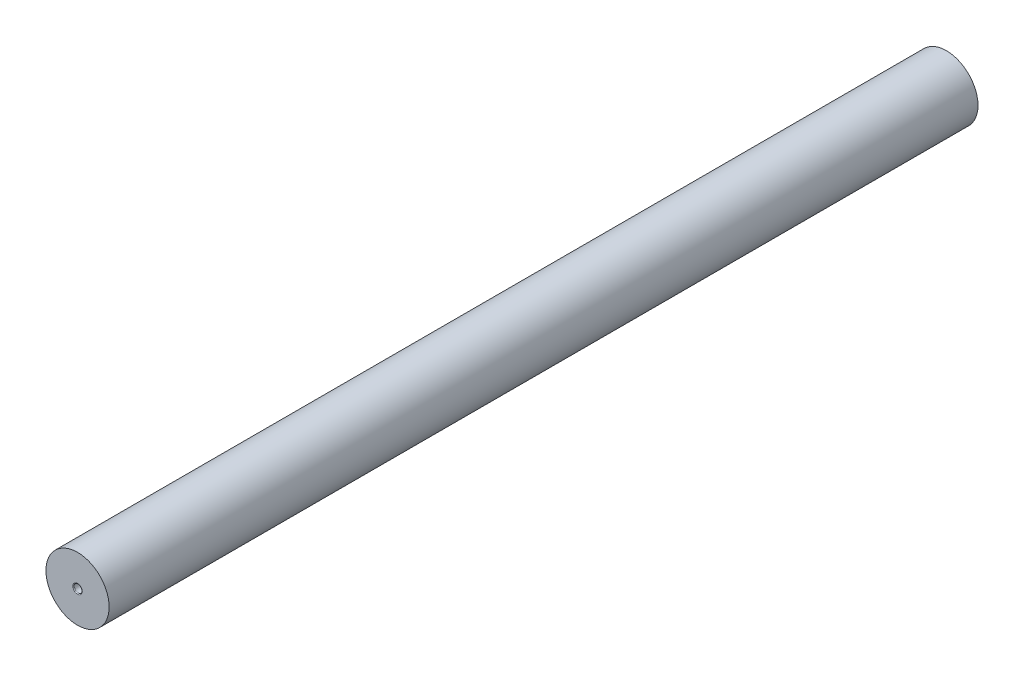
ISO-10303-21;
HEADER;
FILE_DESCRIPTION(('STEP AP214'),'2;1');
FILE_NAME('part.step','',(''),(''),'','','');
FILE_SCHEMA(('AUTOMOTIVE_DESIGN { 1 0 10303 214 1 1 1 1 }'));
ENDSEC;
DATA;
#1=APPLICATION_CONTEXT('core data for automotive mechanical design processes');
#2=APPLICATION_PROTOCOL_DEFINITION('international standard','automotive_design',2000,#1);
#3=PRODUCT_CONTEXT('',#1,'mechanical');
#4=PRODUCT('Part','Part','',(#3));
#5=PRODUCT_RELATED_PRODUCT_CATEGORY('part','',(#4));
#6=PRODUCT_DEFINITION_FORMATION('','',#4);
#7=PRODUCT_DEFINITION_CONTEXT('part definition',#1,'design');
#8=PRODUCT_DEFINITION('design','',#6,#7);
#9=PRODUCT_DEFINITION_SHAPE('','',#8);
#10=(LENGTH_UNIT() NAMED_UNIT(*) SI_UNIT(.MILLI.,.METRE.));
#11=(NAMED_UNIT(*) PLANE_ANGLE_UNIT() SI_UNIT($,.RADIAN.));
#12=(NAMED_UNIT(*) SI_UNIT($,.STERADIAN.) SOLID_ANGLE_UNIT());
#13=UNCERTAINTY_MEASURE_WITH_UNIT(LENGTH_MEASURE(1.E-05),#10,'distance_accuracy_value','');
#14=(GEOMETRIC_REPRESENTATION_CONTEXT(3) GLOBAL_UNCERTAINTY_ASSIGNED_CONTEXT((#13)) GLOBAL_UNIT_ASSIGNED_CONTEXT((#10,
#11,#12)) REPRESENTATION_CONTEXT('',''));
#15=CARTESIAN_POINT('',(0.,0.,0.));
#16=DIRECTION('',(0.,0.,1.));
#17=DIRECTION('',(1.,0.,0.));
#18=AXIS2_PLACEMENT_3D('',#15,#16,#17);
#19=CARTESIAN_POINT('',(0.,0.,110.));
#20=DIRECTION('',(0.,0.,-1.));
#21=DIRECTION('',(-1.,0.,0.));
#22=AXIS2_PLACEMENT_3D('',#19,#20,#21);
#23=CYLINDRICAL_SURFACE('',#22,4.);
#24=CARTESIAN_POINT('',(0.,0.,110.));
#25=DIRECTION('',(0.,0.,1.));
#26=DIRECTION('',(1.,0.,0.));
#27=AXIS2_PLACEMENT_3D('',#24,#25,#26);
#28=CIRCLE('',#27,4.);
#29=CARTESIAN_POINT('',(4.,0.,110.));
#30=VERTEX_POINT('',#29);
#31=EDGE_CURVE('E44',#30,#30,#28,.T.);
#32=ORIENTED_EDGE('',*,*,#31,.F.);
#33=EDGE_LOOP('',(#32));
#34=FACE_BOUND('',#33,.T.);
#35=CARTESIAN_POINT('',(0.,0.,0.));
#36=DIRECTION('',(0.,0.,1.));
#37=DIRECTION('',(1.,0.,0.));
#38=AXIS2_PLACEMENT_3D('',#35,#36,#37);
#39=CIRCLE('',#38,4.);
#40=CARTESIAN_POINT('',(4.,0.,0.));
#41=VERTEX_POINT('',#40);
#42=EDGE_CURVE('E48',#41,#41,#39,.T.);
#43=ORIENTED_EDGE('',*,*,#42,.T.);
#44=EDGE_LOOP('',(#43));
#45=FACE_BOUND('',#44,.T.);
#46=ADVANCED_FACE('F33',(#34,#45),#23,.T.);
#47=CARTESIAN_POINT('',(0.,0.,110.));
#48=DIRECTION('',(0.,0.,1.));
#49=DIRECTION('',(1.,0.,0.));
#50=AXIS2_PLACEMENT_3D('',#47,#48,#49);
#51=PLANE('',#50);
#52=CARTESIAN_POINT('',(0.,0.,110.));
#53=DIRECTION('',(0.,0.,1.));
#54=DIRECTION('',(1.,0.,0.));
#55=AXIS2_PLACEMENT_3D('',#52,#53,#54);
#56=CIRCLE('',#55,0.6);
#57=CARTESIAN_POINT('',(0.6,0.,110.));
#58=VERTEX_POINT('',#57);
#59=EDGE_CURVE('E10',#58,#58,#56,.F.);
#60=ORIENTED_EDGE('',*,*,#59,.T.);
#61=EDGE_LOOP('',(#60));
#62=FACE_BOUND('',#61,.T.);
#63=ORIENTED_EDGE('',*,*,#31,.T.);
#64=EDGE_LOOP('',(#63));
#65=FACE_BOUND('',#64,.T.);
#66=ADVANCED_FACE('F68',(#62,#65),#51,.T.);
#67=CARTESIAN_POINT('',(0.,0.,0.));
#68=DIRECTION('',(0.,0.,1.));
#69=DIRECTION('',(1.,0.,0.));
#70=AXIS2_PLACEMENT_3D('',#67,#68,#69);
#71=PLANE('',#70);
#72=ORIENTED_EDGE('',*,*,#42,.F.);
#73=EDGE_LOOP('',(#72));
#74=FACE_BOUND('',#73,.T.);
#75=ADVANCED_FACE('F61',(#74),#71,.F.);
#76=CARTESIAN_POINT('',(0.,0.,105.));
#77=DIRECTION('',(0.,0.,1.));
#78=DIRECTION('',(1.,0.,0.));
#79=AXIS2_PLACEMENT_3D('',#76,#77,#78);
#80=CYLINDRICAL_SURFACE('',#79,0.5);
#81=CARTESIAN_POINT('',(0.,0.,109.9));
#82=DIRECTION('',(0.,0.,1.));
#83=DIRECTION('',(1.,0.,0.));
#84=AXIS2_PLACEMENT_3D('',#81,#82,#83);
#85=CIRCLE('',#84,0.5);
#86=CARTESIAN_POINT('',(0.5,0.,109.9));
#87=VERTEX_POINT('',#86);
#88=EDGE_CURVE('E40',#87,#87,#85,.T.);
#89=ORIENTED_EDGE('',*,*,#88,.T.);
#90=EDGE_LOOP('',(#89));
#91=FACE_BOUND('',#90,.T.);
#92=CARTESIAN_POINT('',(0.,0.,105.));
#93=DIRECTION('',(0.,0.,1.));
#94=DIRECTION('',(1.,0.,0.));
#95=AXIS2_PLACEMENT_3D('',#92,#93,#94);
#96=CIRCLE('',#95,0.5);
#97=CARTESIAN_POINT('',(0.5,0.,105.));
#98=VERTEX_POINT('',#97);
#99=EDGE_CURVE('E52',#98,#98,#96,.T.);
#100=ORIENTED_EDGE('',*,*,#99,.F.);
#101=EDGE_LOOP('',(#100));
#102=FACE_BOUND('',#101,.T.);
#103=ADVANCED_FACE('F59',(#91,#102),#80,.F.);
#104=CARTESIAN_POINT('',(0.,0.,105.));
#105=DIRECTION('',(0.,0.,1.));
#106=DIRECTION('',(1.,0.,0.));
#107=AXIS2_PLACEMENT_3D('',#104,#105,#106);
#108=PLANE('',#107);
#109=ORIENTED_EDGE('',*,*,#99,.T.);
#110=EDGE_LOOP('',(#109));
#111=FACE_BOUND('',#110,.T.);
#112=ADVANCED_FACE('F57',(#111),#108,.T.);
#113=CARTESIAN_POINT('',(0.,0.,109.9));
#114=DIRECTION('',(0.,0.,1.));
#115=DIRECTION('',(1.,0.,0.));
#116=AXIS2_PLACEMENT_3D('',#113,#114,#115);
#117=TOROIDAL_SURFACE('',#116,0.6,0.1);
#118=ORIENTED_EDGE('',*,*,#59,.F.);
#119=EDGE_LOOP('',(#118));
#120=FACE_BOUND('',#119,.T.);
#121=ORIENTED_EDGE('',*,*,#88,.F.);
#122=EDGE_LOOP('',(#121));
#123=FACE_BOUND('',#122,.T.);
#124=ADVANCED_FACE('F35',(#120,#123),#117,.T.);
#125=CLOSED_SHELL('',(#46,#66,#75,#103,#112,#124));
#126=MANIFOLD_SOLID_BREP('B2',#125);
#127=ADVANCED_BREP_SHAPE_REPRESENTATION('',(#18,#126),#14);
#128=SHAPE_DEFINITION_REPRESENTATION(#9,#127);
ENDSEC;
END-ISO-10303-21;
